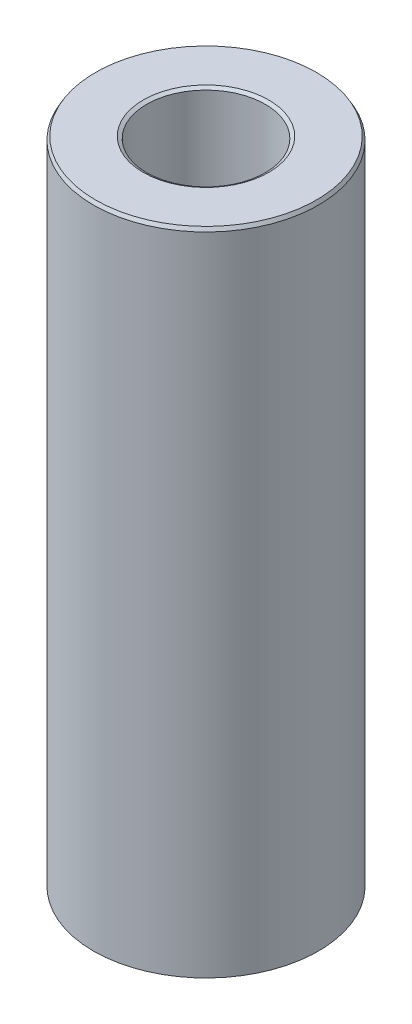
ISO-10303-21;
HEADER;
FILE_DESCRIPTION(('STEP AP214'),'2;1');
FILE_NAME('part.step','',(''),(''),'','','');
FILE_SCHEMA(('AUTOMOTIVE_DESIGN { 1 0 10303 214 1 1 1 1 }'));
ENDSEC;
DATA;
#1=APPLICATION_CONTEXT('core data for automotive mechanical design processes');
#2=APPLICATION_PROTOCOL_DEFINITION('international standard','automotive_design',2000,#1);
#3=PRODUCT_CONTEXT('',#1,'mechanical');
#4=PRODUCT('Part','Part','',(#3));
#5=PRODUCT_RELATED_PRODUCT_CATEGORY('part','',(#4));
#6=PRODUCT_DEFINITION_FORMATION('','',#4);
#7=PRODUCT_DEFINITION_CONTEXT('part definition',#1,'design');
#8=PRODUCT_DEFINITION('design','',#6,#7);
#9=PRODUCT_DEFINITION_SHAPE('','',#8);
#10=(LENGTH_UNIT() NAMED_UNIT(*) SI_UNIT(.MILLI.,.METRE.));
#11=(NAMED_UNIT(*) PLANE_ANGLE_UNIT() SI_UNIT($,.RADIAN.));
#12=(NAMED_UNIT(*) SI_UNIT($,.STERADIAN.) SOLID_ANGLE_UNIT());
#13=UNCERTAINTY_MEASURE_WITH_UNIT(LENGTH_MEASURE(1.E-05),#10,'distance_accuracy_value','');
#14=(GEOMETRIC_REPRESENTATION_CONTEXT(3) GLOBAL_UNCERTAINTY_ASSIGNED_CONTEXT((#13)) GLOBAL_UNIT_ASSIGNED_CONTEXT((#10,
#11,#12)) REPRESENTATION_CONTEXT('',''));
#15=CARTESIAN_POINT('',(0.,0.,0.));
#16=DIRECTION('',(0.,0.,1.));
#17=DIRECTION('',(1.,0.,0.));
#18=AXIS2_PLACEMENT_3D('',#15,#16,#17);
#19=CARTESIAN_POINT('',(0.,260.631117592324,0.));
#20=DIRECTION('',(0.,-1.,0.));
#21=DIRECTION('',(0.,0.,-1.));
#22=AXIS2_PLACEMENT_3D('',#19,#20,#21);
#23=CYLINDRICAL_SURFACE('',#22,45.);
#24=CARTESIAN_POINT('',(0.,0.797764481676067,0.));
#25=DIRECTION('',(0.,1.,0.));
#26=DIRECTION('',(0.,0.,1.));
#27=AXIS2_PLACEMENT_3D('',#24,#25,#26);
#28=CIRCLE('',#27,45.);
#29=CARTESIAN_POINT('',(0.,0.797764481676067,45.));
#30=VERTEX_POINT('',#29);
#31=EDGE_CURVE('E10',#30,#30,#28,.T.);
#32=ORIENTED_EDGE('',*,*,#31,.T.);
#33=EDGE_LOOP('',(#32));
#34=FACE_BOUND('',#33,.T.);
#35=CARTESIAN_POINT('',(0.,259.249348977587,0.));
#36=DIRECTION('',(0.,1.,0.));
#37=DIRECTION('',(0.,0.,1.));
#38=AXIS2_PLACEMENT_3D('',#35,#36,#37);
#39=CIRCLE('',#38,45.);
#40=CARTESIAN_POINT('',(0.,259.249348977587,45.));
#41=VERTEX_POINT('',#40);
#42=EDGE_CURVE('E50',#41,#41,#39,.F.);
#43=ORIENTED_EDGE('',*,*,#42,.T.);
#44=EDGE_LOOP('',(#43));
#45=FACE_BOUND('',#44,.T.);
#46=ADVANCED_FACE('F39',(#34,#45),#23,.T.);
#47=CARTESIAN_POINT('',(0.,260.631117592324,0.));
#48=DIRECTION('',(0.,1.,0.));
#49=DIRECTION('',(0.,0.,1.));
#50=AXIS2_PLACEMENT_3D('',#47,#48,#49);
#51=PLANE('',#50);
#52=CARTESIAN_POINT('',(0.,260.631117592324,0.));
#53=DIRECTION('',(0.,1.,0.));
#54=DIRECTION('',(0.,0.,1.));
#55=AXIS2_PLACEMENT_3D('',#52,#53,#54);
#56=CIRCLE('',#55,25.1117931014773);
#57=CARTESIAN_POINT('',(0.,260.631117592324,25.1117931014773));
#58=VERTEX_POINT('',#57);
#59=EDGE_CURVE('E58',#58,#58,#56,.F.);
#60=ORIENTED_EDGE('',*,*,#59,.T.);
#61=EDGE_LOOP('',(#60));
#62=FACE_BOUND('',#61,.T.);
#63=CARTESIAN_POINT('',(0.,260.631117592324,0.));
#64=DIRECTION('',(0.,1.,0.));
#65=DIRECTION('',(0.,0.,1.));
#66=AXIS2_PLACEMENT_3D('',#63,#64,#65);
#67=CIRCLE('',#66,44.2022355183239);
#68=CARTESIAN_POINT('',(0.,260.631117592324,44.2022355183239));
#69=VERTEX_POINT('',#68);
#70=EDGE_CURVE('E61',#69,#69,#67,.T.);
#71=ORIENTED_EDGE('',*,*,#70,.T.);
#72=EDGE_LOOP('',(#71));
#73=FACE_BOUND('',#72,.T.);
#74=ADVANCED_FACE('F88',(#62,#73),#51,.T.);
#75=CARTESIAN_POINT('',(0.,0.,0.));
#76=DIRECTION('',(0.,1.,0.));
#77=DIRECTION('',(0.,0.,1.));
#78=AXIS2_PLACEMENT_3D('',#75,#76,#77);
#79=PLANE('',#78);
#80=CARTESIAN_POINT('',(0.,0.,0.));
#81=DIRECTION('',(0.,1.,0.));
#82=DIRECTION('',(0.,0.,1.));
#83=AXIS2_PLACEMENT_3D('',#80,#81,#82);
#84=CIRCLE('',#83,24.5277889684166);
#85=CARTESIAN_POINT('',(0.,0.,24.5277889684166));
#86=VERTEX_POINT('',#85);
#87=EDGE_CURVE('E51',#86,#86,#84,.T.);
#88=ORIENTED_EDGE('',*,*,#87,.T.);
#89=EDGE_LOOP('',(#88));
#90=FACE_BOUND('',#89,.T.);
#91=CARTESIAN_POINT('',(0.,0.,0.));
#92=DIRECTION('',(0.,1.,0.));
#93=DIRECTION('',(0.,0.,1.));
#94=AXIS2_PLACEMENT_3D('',#91,#92,#93);
#95=CIRCLE('',#94,43.6182313852632);
#96=CARTESIAN_POINT('',(0.,0.,43.6182313852632));
#97=VERTEX_POINT('',#96);
#98=EDGE_CURVE('E54',#97,#97,#95,.F.);
#99=ORIENTED_EDGE('',*,*,#98,.T.);
#100=EDGE_LOOP('',(#99));
#101=FACE_BOUND('',#100,.T.);
#102=ADVANCED_FACE('F83',(#90,#101),#79,.F.);
#103=CARTESIAN_POINT('',(0.,260.631117592324,0.));
#104=DIRECTION('',(0.,-1.,0.));
#105=DIRECTION('',(0.,0.,-1.));
#106=AXIS2_PLACEMENT_3D('',#103,#104,#105);
#107=CYLINDRICAL_SURFACE('',#106,23.7300244867405);
#108=CARTESIAN_POINT('',(0.,259.833353110647,0.));
#109=DIRECTION('',(0.,1.,0.));
#110=DIRECTION('',(0.,0.,1.));
#111=AXIS2_PLACEMENT_3D('',#108,#109,#110);
#112=CIRCLE('',#111,23.7300244867405);
#113=CARTESIAN_POINT('',(0.,259.833353110647,23.7300244867405));
#114=VERTEX_POINT('',#113);
#115=EDGE_CURVE('E67',#114,#114,#112,.T.);
#116=ORIENTED_EDGE('',*,*,#115,.T.);
#117=EDGE_LOOP('',(#116));
#118=FACE_BOUND('',#117,.T.);
#119=CARTESIAN_POINT('',(0.,1.38176861473688,0.));
#120=DIRECTION('',(0.,1.,0.));
#121=DIRECTION('',(0.,0.,1.));
#122=AXIS2_PLACEMENT_3D('',#119,#120,#121);
#123=CIRCLE('',#122,23.7300244867405);
#124=CARTESIAN_POINT('',(0.,1.38176861473688,23.7300244867405));
#125=VERTEX_POINT('',#124);
#126=EDGE_CURVE('E69',#125,#125,#123,.F.);
#127=ORIENTED_EDGE('',*,*,#126,.T.);
#128=EDGE_LOOP('',(#127));
#129=FACE_BOUND('',#128,.T.);
#130=ADVANCED_FACE('F71',(#118,#129),#107,.F.);
#131=CARTESIAN_POINT('',(0.,259.833353110647,0.));
#132=DIRECTION('',(0.,1.,0.));
#133=DIRECTION('',(0.,0.,1.));
#134=AXIS2_PLACEMENT_3D('',#131,#132,#133);
#135=CONICAL_SURFACE('',#134,23.7300244867405,1.0471975511966);
#136=ORIENTED_EDGE('',*,*,#59,.F.);
#137=EDGE_LOOP('',(#136));
#138=FACE_BOUND('',#137,.T.);
#139=ORIENTED_EDGE('',*,*,#115,.F.);
#140=EDGE_LOOP('',(#139));
#141=FACE_BOUND('',#140,.T.);
#142=ADVANCED_FACE('F77',(#138,#141),#135,.F.);
#143=CARTESIAN_POINT('',(0.,0.,0.));
#144=DIRECTION('',(0.,-1.,0.));
#145=DIRECTION('',(0.,0.,-1.));
#146=AXIS2_PLACEMENT_3D('',#143,#144,#145);
#147=CONICAL_SURFACE('',#146,24.5277889684166,0.523598775598289);
#148=ORIENTED_EDGE('',*,*,#126,.F.);
#149=EDGE_LOOP('',(#148));
#150=FACE_BOUND('',#149,.T.);
#151=ORIENTED_EDGE('',*,*,#87,.F.);
#152=EDGE_LOOP('',(#151));
#153=FACE_BOUND('',#152,.T.);
#154=ADVANCED_FACE('F73',(#150,#153),#147,.F.);
#155=CARTESIAN_POINT('',(0.,0.797764481676067,0.));
#156=DIRECTION('',(0.,1.,0.));
#157=DIRECTION('',(0.,0.,1.));
#158=AXIS2_PLACEMENT_3D('',#155,#156,#157);
#159=CONICAL_SURFACE('',#158,45.,1.04719755119659);
#160=ORIENTED_EDGE('',*,*,#98,.F.);
#161=EDGE_LOOP('',(#160));
#162=FACE_BOUND('',#161,.T.);
#163=ORIENTED_EDGE('',*,*,#31,.F.);
#164=EDGE_LOOP('',(#163));
#165=FACE_BOUND('',#164,.T.);
#166=ADVANCED_FACE('F76',(#162,#165),#159,.T.);
#167=CARTESIAN_POINT('',(0.,260.631117592324,0.));
#168=DIRECTION('',(0.,-1.,0.));
#169=DIRECTION('',(0.,0.,-1.));
#170=AXIS2_PLACEMENT_3D('',#167,#168,#169);
#171=CONICAL_SURFACE('',#170,44.2022355183239,0.5235987755983);
#172=ORIENTED_EDGE('',*,*,#42,.F.);
#173=EDGE_LOOP('',(#172));
#174=FACE_BOUND('',#173,.T.);
#175=ORIENTED_EDGE('',*,*,#70,.F.);
#176=EDGE_LOOP('',(#175));
#177=FACE_BOUND('',#176,.T.);
#178=ADVANCED_FACE('F45',(#174,#177),#171,.T.);
#179=CLOSED_SHELL('',(#46,#74,#102,#130,#142,#154,#166,#178));
#180=MANIFOLD_SOLID_BREP('B2',#179);
#181=ADVANCED_BREP_SHAPE_REPRESENTATION('',(#18,#180),#14);
#182=SHAPE_DEFINITION_REPRESENTATION(#9,#181);
ENDSEC;
END-ISO-10303-21;
